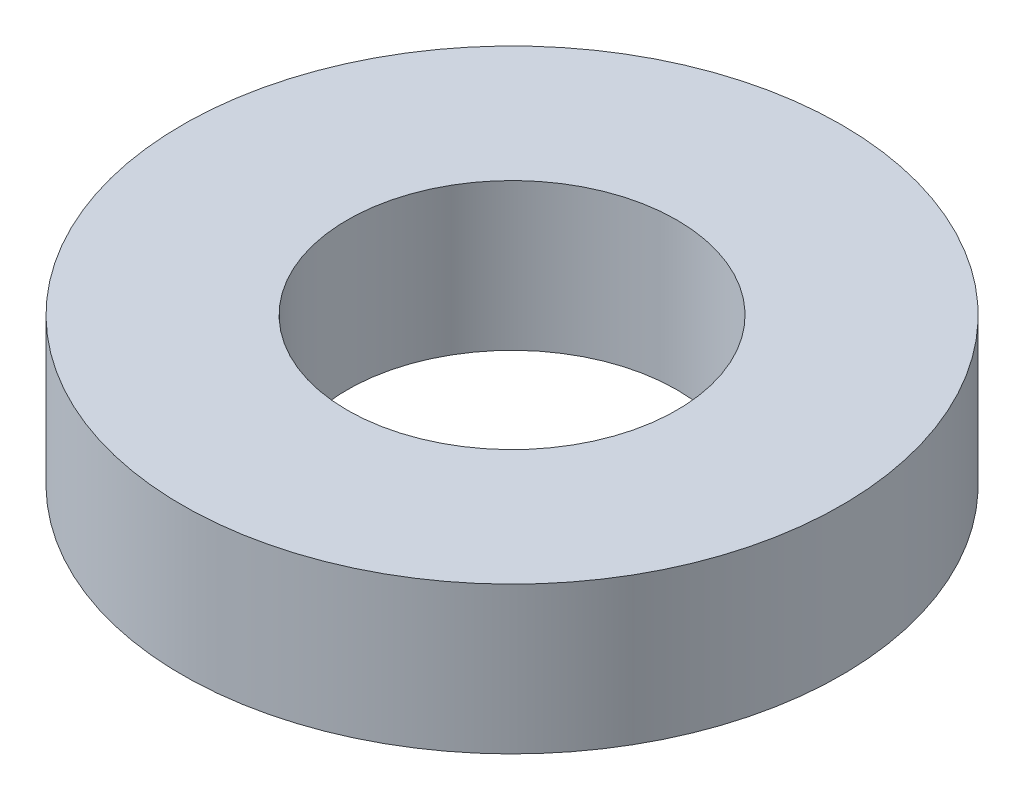
ISO-10303-21;
HEADER;
FILE_DESCRIPTION(('STEP AP214'),'2;1');
FILE_NAME('part.step','',(''),(''),'','','');
FILE_SCHEMA(('AUTOMOTIVE_DESIGN { 1 0 10303 214 1 1 1 1 }'));
ENDSEC;
DATA;
#1=APPLICATION_CONTEXT('core data for automotive mechanical design processes');
#2=APPLICATION_PROTOCOL_DEFINITION('international standard','automotive_design',2000,#1);
#3=PRODUCT_CONTEXT('',#1,'mechanical');
#4=PRODUCT('Part','Part','',(#3));
#5=PRODUCT_RELATED_PRODUCT_CATEGORY('part','',(#4));
#6=PRODUCT_DEFINITION_FORMATION('','',#4);
#7=PRODUCT_DEFINITION_CONTEXT('part definition',#1,'design');
#8=PRODUCT_DEFINITION('design','',#6,#7);
#9=PRODUCT_DEFINITION_SHAPE('','',#8);
#10=(LENGTH_UNIT() NAMED_UNIT(*) SI_UNIT(.MILLI.,.METRE.));
#11=(NAMED_UNIT(*) PLANE_ANGLE_UNIT() SI_UNIT($,.RADIAN.));
#12=(NAMED_UNIT(*) SI_UNIT($,.STERADIAN.) SOLID_ANGLE_UNIT());
#13=UNCERTAINTY_MEASURE_WITH_UNIT(LENGTH_MEASURE(1.E-05),#10,'distance_accuracy_value','');
#14=(GEOMETRIC_REPRESENTATION_CONTEXT(3) GLOBAL_UNCERTAINTY_ASSIGNED_CONTEXT((#13)) GLOBAL_UNIT_ASSIGNED_CONTEXT((#10,
#11,#12)) REPRESENTATION_CONTEXT('',''));
#15=CARTESIAN_POINT('',(0.,0.,0.));
#16=DIRECTION('',(0.,0.,1.));
#17=DIRECTION('',(1.,0.,0.));
#18=AXIS2_PLACEMENT_3D('',#15,#16,#17);
#19=CARTESIAN_POINT('',(0.,29.,0.));
#20=DIRECTION('',(0.,-1.,0.));
#21=DIRECTION('',(0.,0.,-1.));
#22=AXIS2_PLACEMENT_3D('',#19,#20,#21);
#23=CYLINDRICAL_SURFACE('',#22,65.);
#24=CARTESIAN_POINT('',(0.,29.,0.));
#25=DIRECTION('',(0.,1.,0.));
#26=DIRECTION('',(0.,0.,1.));
#27=AXIS2_PLACEMENT_3D('',#24,#25,#26);
#28=CIRCLE('',#27,65.);
#29=CARTESIAN_POINT('',(0.,29.,-65.));
#30=VERTEX_POINT('',#29);
#31=EDGE_CURVE('E10',#30,#30,#28,.T.);
#32=CARTESIAN_POINT('',(0.,0.,0.));
#33=DIRECTION('',(0.,1.,0.));
#34=DIRECTION('',(0.,0.,1.));
#35=AXIS2_PLACEMENT_3D('',#32,#33,#34);
#36=CIRCLE('',#35,65.);
#37=CARTESIAN_POINT('',(0.,0.,-65.));
#38=VERTEX_POINT('',#37);
#39=EDGE_CURVE('E37',#38,#38,#36,.T.);
#40=CARTESIAN_POINT('',(0.,29.,-65.));
#41=CARTESIAN_POINT('',(0.,28.6979166666667,-65.));
#42=CARTESIAN_POINT('',(0.,28.3958333333333,-65.));
#43=CARTESIAN_POINT('',(0.,27.7916666666667,-65.));
#44=CARTESIAN_POINT('',(0.,27.4895833333333,-65.));
#45=CARTESIAN_POINT('',(0.,26.8854166666667,-65.));
#46=CARTESIAN_POINT('',(0.,26.5833333333333,-65.));
#47=CARTESIAN_POINT('',(0.,25.9791666666667,-65.));
#48=CARTESIAN_POINT('',(0.,25.6770833333333,-65.));
#49=CARTESIAN_POINT('',(0.,25.0729166666667,-65.));
#50=CARTESIAN_POINT('',(0.,24.7708333333333,-65.));
#51=CARTESIAN_POINT('',(0.,24.1666666666667,-65.));
#52=CARTESIAN_POINT('',(0.,23.8645833333333,-65.));
#53=CARTESIAN_POINT('',(0.,23.2604166666667,-65.));
#54=CARTESIAN_POINT('',(0.,22.9583333333333,-65.));
#55=CARTESIAN_POINT('',(0.,22.3541666666667,-65.));
#56=CARTESIAN_POINT('',(0.,22.0520833333333,-65.));
#57=CARTESIAN_POINT('',(0.,21.4479166666667,-65.));
#58=CARTESIAN_POINT('',(0.,21.1458333333333,-65.));
#59=CARTESIAN_POINT('',(0.,20.5416666666667,-65.));
#60=CARTESIAN_POINT('',(0.,20.2395833333333,-65.));
#61=CARTESIAN_POINT('',(0.,19.6354166666667,-65.));
#62=CARTESIAN_POINT('',(0.,19.3333333333333,-65.));
#63=CARTESIAN_POINT('',(0.,18.7291666666667,-65.));
#64=CARTESIAN_POINT('',(0.,18.4270833333333,-65.));
#65=CARTESIAN_POINT('',(0.,17.8229166666667,-65.));
#66=CARTESIAN_POINT('',(0.,17.5208333333333,-65.));
#67=CARTESIAN_POINT('',(0.,16.9166666666667,-65.));
#68=CARTESIAN_POINT('',(0.,16.6145833333333,-65.));
#69=CARTESIAN_POINT('',(0.,16.0104166666667,-65.));
#70=CARTESIAN_POINT('',(0.,15.7083333333333,-65.));
#71=CARTESIAN_POINT('',(0.,15.1041666666667,-65.));
#72=CARTESIAN_POINT('',(0.,14.8020833333333,-65.));
#73=CARTESIAN_POINT('',(0.,14.1979166666667,-65.));
#74=CARTESIAN_POINT('',(0.,13.8958333333333,-65.));
#75=CARTESIAN_POINT('',(0.,13.2916666666667,-65.));
#76=CARTESIAN_POINT('',(0.,12.9895833333333,-65.));
#77=CARTESIAN_POINT('',(0.,12.3854166666667,-65.));
#78=CARTESIAN_POINT('',(0.,12.0833333333333,-65.));
#79=CARTESIAN_POINT('',(0.,11.4791666666667,-65.));
#80=CARTESIAN_POINT('',(0.,11.1770833333333,-65.));
#81=CARTESIAN_POINT('',(0.,10.5729166666667,-65.));
#82=CARTESIAN_POINT('',(0.,10.2708333333333,-65.));
#83=CARTESIAN_POINT('',(0.,9.66666666666667,-65.));
#84=CARTESIAN_POINT('',(0.,9.36458333333333,-65.));
#85=CARTESIAN_POINT('',(0.,8.76041666666667,-65.));
#86=CARTESIAN_POINT('',(0.,8.45833333333333,-65.));
#87=CARTESIAN_POINT('',(0.,7.85416666666667,-65.));
#88=CARTESIAN_POINT('',(0.,7.55208333333333,-65.));
#89=CARTESIAN_POINT('',(0.,6.94791666666667,-65.));
#90=CARTESIAN_POINT('',(0.,6.64583333333333,-65.));
#91=CARTESIAN_POINT('',(0.,6.04166666666667,-65.));
#92=CARTESIAN_POINT('',(0.,5.73958333333333,-65.));
#93=CARTESIAN_POINT('',(0.,5.13541666666667,-65.));
#94=CARTESIAN_POINT('',(0.,4.83333333333333,-65.));
#95=CARTESIAN_POINT('',(0.,4.22916666666667,-65.));
#96=CARTESIAN_POINT('',(0.,3.92708333333333,-65.));
#97=CARTESIAN_POINT('',(0.,3.32291666666667,-65.));
#98=CARTESIAN_POINT('',(0.,3.02083333333333,-65.));
#99=CARTESIAN_POINT('',(0.,2.41666666666667,-65.));
#100=CARTESIAN_POINT('',(0.,2.11458333333333,-65.));
#101=CARTESIAN_POINT('',(0.,1.51041666666667,-65.));
#102=CARTESIAN_POINT('',(0.,1.20833333333333,-65.));
#103=CARTESIAN_POINT('',(0.,0.604166666666667,-65.));
#104=CARTESIAN_POINT('',(0.,0.302083333333333,-65.));
#105=CARTESIAN_POINT('',(0.,0.,-65.));
#106=B_SPLINE_CURVE_WITH_KNOTS('',3,(#40,#41,#42,#43,#44,#45,#46,#47,#48,#49,#50,#51,#52,#53,
#54,#55,#56,#57,#58,#59,#60,#61,#62,#63,#64,#65,#66,#67,#68,#69,#70,#71,#72,#73,#74,#75,#76,#77,
#78,#79,#80,#81,#82,#83,#84,#85,#86,#87,#88,#89,#90,#91,#92,#93,#94,#95,#96,#97,#98,#99,#100,
#101,#102,#103,#104,#105),.UNSPECIFIED.,.F.,.F.,(4,2,2,2,2,2,2,2,2,2,2,2,2,2,2,2,2,2,2,2,2,2,2,
2,2,2,2,2,2,2,2,2,4),(0.,0.906249999999997,1.8125,2.71875,3.625,4.53125,5.4375,6.34375,7.25,
8.15625,9.0625,9.96875,10.875,11.78125,12.6875,13.59375,14.5,15.40625,16.3125,17.21875,18.125,
19.03125,19.9375,20.84375,21.75,22.65625,23.5625,24.46875,25.375,26.28125,27.1875,28.09375,29.),.UNSPECIFIED.);
#107=EDGE_CURVE('BSEAM40',#30,#38,#106,.T.);
#108=ORIENTED_EDGE('',*,*,#31,.F.);
#109=ORIENTED_EDGE('',*,*,#39,.T.);
#110=ORIENTED_EDGE('',*,*,#107,.T.);
#111=ORIENTED_EDGE('',*,*,#107,.F.);
#112=EDGE_LOOP('',(#108,#110,#109,#111));
#113=FACE_BOUND('',#112,.T.);
#114=ADVANCED_FACE('F40',(#113),#23,.T.);
#115=CARTESIAN_POINT('',(0.,29.,0.));
#116=DIRECTION('',(0.,1.,0.));
#117=DIRECTION('',(0.,0.,1.));
#118=AXIS2_PLACEMENT_3D('',#115,#116,#117);
#119=PLANE('',#118);
#120=CARTESIAN_POINT('',(0.,29.,0.));
#121=DIRECTION('',(0.,1.,0.));
#122=DIRECTION('',(0.,0.,1.));
#123=AXIS2_PLACEMENT_3D('',#120,#121,#122);
#124=CIRCLE('',#123,32.5);
#125=CARTESIAN_POINT('',(0.,29.,-32.5));
#126=VERTEX_POINT('',#125);
#127=EDGE_CURVE('E50',#126,#126,#124,.T.);
#128=ORIENTED_EDGE('',*,*,#127,.F.);
#129=EDGE_LOOP('',(#128));
#130=FACE_BOUND('',#129,.T.);
#131=ORIENTED_EDGE('',*,*,#31,.T.);
#132=EDGE_LOOP('',(#131));
#133=FACE_BOUND('',#132,.T.);
#134=ADVANCED_FACE('F59',(#130,#133),#119,.T.);
#135=CARTESIAN_POINT('',(0.,0.,0.));
#136=DIRECTION('',(0.,1.,0.));
#137=DIRECTION('',(0.,0.,1.));
#138=AXIS2_PLACEMENT_3D('',#135,#136,#137);
#139=PLANE('',#138);
#140=CARTESIAN_POINT('',(0.,0.,0.));
#141=DIRECTION('',(0.,1.,0.));
#142=DIRECTION('',(0.,0.,1.));
#143=AXIS2_PLACEMENT_3D('',#140,#141,#142);
#144=CIRCLE('',#143,32.5);
#145=CARTESIAN_POINT('',(0.,0.,-32.5));
#146=VERTEX_POINT('',#145);
#147=EDGE_CURVE('E47',#146,#146,#144,.T.);
#148=ORIENTED_EDGE('',*,*,#147,.T.);
#149=EDGE_LOOP('',(#148));
#150=FACE_BOUND('',#149,.T.);
#151=ORIENTED_EDGE('',*,*,#39,.F.);
#152=EDGE_LOOP('',(#151));
#153=FACE_BOUND('',#152,.T.);
#154=ADVANCED_FACE('F58',(#150,#153),#139,.F.);
#155=CARTESIAN_POINT('',(0.,29.,0.));
#156=DIRECTION('',(0.,-1.,0.));
#157=DIRECTION('',(0.,0.,-1.));
#158=AXIS2_PLACEMENT_3D('',#155,#156,#157);
#159=CYLINDRICAL_SURFACE('',#158,32.5);
#160=CARTESIAN_POINT('',(0.,29.,-32.5));
#161=CARTESIAN_POINT('',(0.,28.6979166666667,-32.5));
#162=CARTESIAN_POINT('',(0.,28.3958333333333,-32.5));
#163=CARTESIAN_POINT('',(0.,27.7916666666667,-32.5));
#164=CARTESIAN_POINT('',(0.,27.4895833333333,-32.5));
#165=CARTESIAN_POINT('',(0.,26.8854166666667,-32.5));
#166=CARTESIAN_POINT('',(0.,26.5833333333333,-32.5));
#167=CARTESIAN_POINT('',(0.,25.9791666666667,-32.5));
#168=CARTESIAN_POINT('',(0.,25.6770833333333,-32.5));
#169=CARTESIAN_POINT('',(0.,25.0729166666667,-32.5));
#170=CARTESIAN_POINT('',(0.,24.7708333333333,-32.5));
#171=CARTESIAN_POINT('',(0.,24.1666666666667,-32.5));
#172=CARTESIAN_POINT('',(0.,23.8645833333333,-32.5));
#173=CARTESIAN_POINT('',(0.,23.2604166666667,-32.5));
#174=CARTESIAN_POINT('',(0.,22.9583333333333,-32.5));
#175=CARTESIAN_POINT('',(0.,22.3541666666667,-32.5));
#176=CARTESIAN_POINT('',(0.,22.0520833333333,-32.5));
#177=CARTESIAN_POINT('',(0.,21.4479166666667,-32.5));
#178=CARTESIAN_POINT('',(0.,21.1458333333333,-32.5));
#179=CARTESIAN_POINT('',(0.,20.5416666666667,-32.5));
#180=CARTESIAN_POINT('',(0.,20.2395833333333,-32.5));
#181=CARTESIAN_POINT('',(0.,19.6354166666667,-32.5));
#182=CARTESIAN_POINT('',(0.,19.3333333333333,-32.5));
#183=CARTESIAN_POINT('',(0.,18.7291666666667,-32.5));
#184=CARTESIAN_POINT('',(0.,18.4270833333333,-32.5));
#185=CARTESIAN_POINT('',(0.,17.8229166666667,-32.5));
#186=CARTESIAN_POINT('',(0.,17.5208333333333,-32.5));
#187=CARTESIAN_POINT('',(0.,16.9166666666667,-32.5));
#188=CARTESIAN_POINT('',(0.,16.6145833333333,-32.5));
#189=CARTESIAN_POINT('',(0.,16.0104166666667,-32.5));
#190=CARTESIAN_POINT('',(0.,15.7083333333333,-32.5));
#191=CARTESIAN_POINT('',(0.,15.1041666666667,-32.5));
#192=CARTESIAN_POINT('',(0.,14.8020833333333,-32.5));
#193=CARTESIAN_POINT('',(0.,14.1979166666667,-32.5));
#194=CARTESIAN_POINT('',(0.,13.8958333333333,-32.5));
#195=CARTESIAN_POINT('',(0.,13.2916666666667,-32.5));
#196=CARTESIAN_POINT('',(0.,12.9895833333333,-32.5));
#197=CARTESIAN_POINT('',(0.,12.3854166666667,-32.5));
#198=CARTESIAN_POINT('',(0.,12.0833333333333,-32.5));
#199=CARTESIAN_POINT('',(0.,11.4791666666667,-32.5));
#200=CARTESIAN_POINT('',(0.,11.1770833333333,-32.5));
#201=CARTESIAN_POINT('',(0.,10.5729166666667,-32.5));
#202=CARTESIAN_POINT('',(0.,10.2708333333333,-32.5));
#203=CARTESIAN_POINT('',(0.,9.66666666666667,-32.5));
#204=CARTESIAN_POINT('',(0.,9.36458333333333,-32.5));
#205=CARTESIAN_POINT('',(0.,8.76041666666667,-32.5));
#206=CARTESIAN_POINT('',(0.,8.45833333333333,-32.5));
#207=CARTESIAN_POINT('',(0.,7.85416666666667,-32.5));
#208=CARTESIAN_POINT('',(0.,7.55208333333333,-32.5));
#209=CARTESIAN_POINT('',(0.,6.94791666666667,-32.5));
#210=CARTESIAN_POINT('',(0.,6.64583333333333,-32.5));
#211=CARTESIAN_POINT('',(0.,6.04166666666667,-32.5));
#212=CARTESIAN_POINT('',(0.,5.73958333333333,-32.5));
#213=CARTESIAN_POINT('',(0.,5.13541666666667,-32.5));
#214=CARTESIAN_POINT('',(0.,4.83333333333333,-32.5));
#215=CARTESIAN_POINT('',(0.,4.22916666666667,-32.5));
#216=CARTESIAN_POINT('',(0.,3.92708333333333,-32.5));
#217=CARTESIAN_POINT('',(0.,3.32291666666667,-32.5));
#218=CARTESIAN_POINT('',(0.,3.02083333333333,-32.5));
#219=CARTESIAN_POINT('',(0.,2.41666666666667,-32.5));
#220=CARTESIAN_POINT('',(0.,2.11458333333333,-32.5));
#221=CARTESIAN_POINT('',(0.,1.51041666666667,-32.5));
#222=CARTESIAN_POINT('',(0.,1.20833333333333,-32.5));
#223=CARTESIAN_POINT('',(0.,0.604166666666667,-32.5));
#224=CARTESIAN_POINT('',(0.,0.302083333333333,-32.5));
#225=CARTESIAN_POINT('',(0.,0.,-32.5));
#226=B_SPLINE_CURVE_WITH_KNOTS('',3,(#160,#161,#162,#163,#164,#165,#166,#167,#168,#169,#170,
#171,#172,#173,#174,#175,#176,#177,#178,#179,#180,#181,#182,#183,#184,#185,#186,#187,#188,#189,
#190,#191,#192,#193,#194,#195,#196,#197,#198,#199,#200,#201,#202,#203,#204,#205,#206,#207,#208,
#209,#210,#211,#212,#213,#214,#215,#216,#217,#218,#219,#220,#221,#222,#223,#224,#225),
.UNSPECIFIED.,.F.,.F.,(4,2,2,2,2,2,2,2,2,2,2,2,2,2,2,2,2,2,2,2,2,2,2,2,2,2,2,2,2,2,2,2,4),(0.,
0.906249999999997,1.8125,2.71875,3.625,4.53125,5.4375,6.34375,7.25,8.15625,9.0625,9.96875,
10.875,11.78125,12.6875,13.59375,14.5,15.40625,16.3125,17.21875,18.125,19.03125,19.9375,
20.84375,21.75,22.65625,23.5625,24.46875,25.375,26.28125,27.1875,28.09375,29.),.UNSPECIFIED.);
#227=EDGE_CURVE('BSEAM54',#126,#146,#226,.T.);
#228=ORIENTED_EDGE('',*,*,#127,.T.);
#229=ORIENTED_EDGE('',*,*,#147,.F.);
#230=ORIENTED_EDGE('',*,*,#227,.T.);
#231=ORIENTED_EDGE('',*,*,#227,.F.);
#232=EDGE_LOOP('',(#228,#230,#229,#231));
#233=FACE_BOUND('',#232,.T.);
#234=ADVANCED_FACE('F54',(#233),#159,.F.);
#235=CLOSED_SHELL('',(#114,#134,#154,#234));
#236=MANIFOLD_SOLID_BREP('B2',#235);
#237=ADVANCED_BREP_SHAPE_REPRESENTATION('',(#18,#236),#14);
#238=SHAPE_DEFINITION_REPRESENTATION(#9,#237);
ENDSEC;
END-ISO-10303-21;
